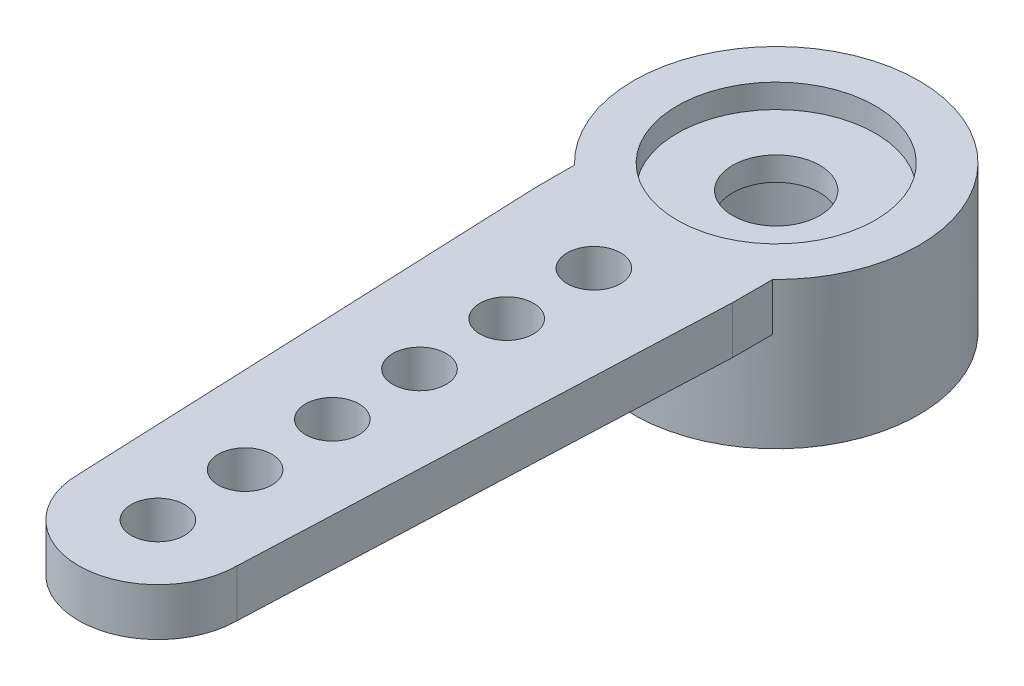
ISO-10303-21;
HEADER;
FILE_DESCRIPTION(('STEP AP214'),'2;1');
FILE_NAME('part.step','',(''),(''),'','','');
FILE_SCHEMA(('AUTOMOTIVE_DESIGN { 1 0 10303 214 1 1 1 1 }'));
ENDSEC;
DATA;
#1=APPLICATION_CONTEXT('core data for automotive mechanical design processes');
#2=APPLICATION_PROTOCOL_DEFINITION('international standard','automotive_design',2000,#1);
#3=PRODUCT_CONTEXT('',#1,'mechanical');
#4=PRODUCT('Part','Part','',(#3));
#5=PRODUCT_RELATED_PRODUCT_CATEGORY('part','',(#4));
#6=PRODUCT_DEFINITION_FORMATION('','',#4);
#7=PRODUCT_DEFINITION_CONTEXT('part definition',#1,'design');
#8=PRODUCT_DEFINITION('design','',#6,#7);
#9=PRODUCT_DEFINITION_SHAPE('','',#8);
#10=(LENGTH_UNIT() NAMED_UNIT(*) SI_UNIT(.MILLI.,.METRE.));
#11=(NAMED_UNIT(*) PLANE_ANGLE_UNIT() SI_UNIT($,.RADIAN.));
#12=(NAMED_UNIT(*) SI_UNIT($,.STERADIAN.) SOLID_ANGLE_UNIT());
#13=UNCERTAINTY_MEASURE_WITH_UNIT(LENGTH_MEASURE(1.E-05),#10,'distance_accuracy_value','');
#14=(GEOMETRIC_REPRESENTATION_CONTEXT(3) GLOBAL_UNCERTAINTY_ASSIGNED_CONTEXT((#13)) GLOBAL_UNIT_ASSIGNED_CONTEXT((#10,
#11,#12)) REPRESENTATION_CONTEXT('',''));
#15=CARTESIAN_POINT('',(0.,0.,0.));
#16=DIRECTION('',(0.,0.,1.));
#17=DIRECTION('',(1.,0.,0.));
#18=AXIS2_PLACEMENT_3D('',#15,#16,#17);
#19=CARTESIAN_POINT('',(0.,0.,7.));
#20=DIRECTION('',(0.,1.,0.));
#21=DIRECTION('',(1.,0.,0.));
#22=AXIS2_PLACEMENT_3D('',#19,#20,#21);
#23=PLANE('',#22);
#24=CARTESIAN_POINT('',(0.,0.,9.));
#25=DIRECTION('',(0.,-1.,0.));
#26=DIRECTION('',(1.,0.,0.));
#27=AXIS2_PLACEMENT_3D('',#24,#25,#26);
#28=CIRCLE('',#27,0.675);
#29=CARTESIAN_POINT('',(-0.675,0.,9.));
#30=VERTEX_POINT('',#29);
#31=EDGE_CURVE('E277',#30,#30,#28,.T.);
#32=ORIENTED_EDGE('',*,*,#31,.F.);
#33=EDGE_LOOP('',(#32));
#34=FACE_BOUND('',#33,.T.);
#35=CARTESIAN_POINT('',(0.,0.,13.4));
#36=DIRECTION('',(0.,-1.,0.));
#37=DIRECTION('',(1.,0.,0.));
#38=AXIS2_PLACEMENT_3D('',#35,#36,#37);
#39=CIRCLE('',#38,0.675);
#40=CARTESIAN_POINT('',(-0.675,0.,13.4));
#41=VERTEX_POINT('',#40);
#42=EDGE_CURVE('E225',#41,#41,#39,.T.);
#43=ORIENTED_EDGE('',*,*,#42,.F.);
#44=EDGE_LOOP('',(#43));
#45=FACE_BOUND('',#44,.T.);
#46=CARTESIAN_POINT('',(0.,0.,4.6));
#47=DIRECTION('',(0.,-1.,0.));
#48=DIRECTION('',(1.,0.,0.));
#49=AXIS2_PLACEMENT_3D('',#46,#47,#48);
#50=CIRCLE('',#49,0.675);
#51=CARTESIAN_POINT('',(-0.675,0.,4.6));
#52=VERTEX_POINT('',#51);
#53=EDGE_CURVE('E195',#52,#52,#50,.T.);
#54=ORIENTED_EDGE('',*,*,#53,.F.);
#55=EDGE_LOOP('',(#54));
#56=FACE_BOUND('',#55,.T.);
#57=CARTESIAN_POINT('',(0.,0.,11.2));
#58=DIRECTION('',(0.,-1.,0.));
#59=DIRECTION('',(1.,0.,0.));
#60=AXIS2_PLACEMENT_3D('',#57,#58,#59);
#61=CIRCLE('',#60,0.675);
#62=CARTESIAN_POINT('',(-0.675,0.,11.2));
#63=VERTEX_POINT('',#62);
#64=EDGE_CURVE('E269',#63,#63,#61,.T.);
#65=ORIENTED_EDGE('',*,*,#64,.F.);
#66=EDGE_LOOP('',(#65));
#67=FACE_BOUND('',#66,.T.);
#68=CARTESIAN_POINT('',(0.,0.,15.6));
#69=DIRECTION('',(0.,-1.,0.));
#70=DIRECTION('',(1.,0.,0.));
#71=AXIS2_PLACEMENT_3D('',#68,#69,#70);
#72=CIRCLE('',#71,0.675);
#73=CARTESIAN_POINT('',(-0.675,0.,15.6));
#74=VERTEX_POINT('',#73);
#75=EDGE_CURVE('E193',#74,#74,#72,.T.);
#76=ORIENTED_EDGE('',*,*,#75,.F.);
#77=EDGE_LOOP('',(#76));
#78=FACE_BOUND('',#77,.T.);
#79=CARTESIAN_POINT('',(0.,0.,6.8));
#80=DIRECTION('',(0.,-1.,0.));
#81=DIRECTION('',(1.,0.,0.));
#82=AXIS2_PLACEMENT_3D('',#79,#80,#81);
#83=CIRCLE('',#82,0.675);
#84=CARTESIAN_POINT('',(-0.675,0.,6.8));
#85=VERTEX_POINT('',#84);
#86=EDGE_CURVE('E20',#85,#85,#83,.T.);
#87=ORIENTED_EDGE('',*,*,#86,.F.);
#88=EDGE_LOOP('',(#87));
#89=FACE_BOUND('',#88,.T.);
#90=CARTESIAN_POINT('',(0.,0.,0.));
#91=DIRECTION('',(0.,1.,0.));
#92=DIRECTION('',(1.,0.,0.));
#93=AXIS2_PLACEMENT_3D('',#90,#91,#92);
#94=CIRCLE('',#93,3.6);
#95=CARTESIAN_POINT('',(-2.5,0.,2.59036676939772));
#96=VERTEX_POINT('',#95);
#97=CARTESIAN_POINT('',(2.5,0.,2.59036676939772));
#98=VERTEX_POINT('',#97);
#99=EDGE_CURVE('E203',#96,#98,#94,.T.);
#100=ORIENTED_EDGE('',*,*,#99,.T.);
#101=DIRECTION('',(0.,0.,-1.));
#102=VECTOR('',#101,1.);
#103=CARTESIAN_POINT('',(2.5,0.,3.6));
#104=LINE('',#103,#102);
#105=CARTESIAN_POINT('',(2.5,0.,3.6));
#106=VERTEX_POINT('',#105);
#107=EDGE_CURVE('E187',#106,#98,#104,.T.);
#108=ORIENTED_EDGE('',*,*,#107,.F.);
#109=DIRECTION('',(0.0416305447121812,0.,-0.999133073092352));
#110=VECTOR('',#109,1.);
#111=CARTESIAN_POINT('',(2.,0.,15.6));
#112=LINE('',#111,#110);
#113=CARTESIAN_POINT('',(2.,0.,15.6));
#114=VERTEX_POINT('',#113);
#115=EDGE_CURVE('E213',#114,#106,#112,.T.);
#116=ORIENTED_EDGE('',*,*,#115,.F.);
#117=CARTESIAN_POINT('',(0.,0.,15.6));
#118=DIRECTION('',(0.,1.,0.));
#119=DIRECTION('',(-1.,0.,0.));
#120=AXIS2_PLACEMENT_3D('',#117,#118,#119);
#121=CIRCLE('',#120,2.);
#122=CARTESIAN_POINT('',(-2.,0.,15.6));
#123=VERTEX_POINT('',#122);
#124=EDGE_CURVE('E301',#123,#114,#121,.T.);
#125=ORIENTED_EDGE('',*,*,#124,.F.);
#126=DIRECTION('',(-0.0416305447121814,0.,-0.999133073092352));
#127=VECTOR('',#126,1.);
#128=CARTESIAN_POINT('',(-2.,0.,15.6));
#129=LINE('',#128,#127);
#130=CARTESIAN_POINT('',(-2.5,0.,3.6));
#131=VERTEX_POINT('',#130);
#132=EDGE_CURVE('E27',#123,#131,#129,.T.);
#133=ORIENTED_EDGE('',*,*,#132,.T.);
#134=DIRECTION('',(0.,0.,-1.));
#135=VECTOR('',#134,1.);
#136=CARTESIAN_POINT('',(-2.5,0.,3.6));
#137=LINE('',#136,#135);
#138=EDGE_CURVE('E241',#131,#96,#137,.T.);
#139=ORIENTED_EDGE('',*,*,#138,.T.);
#140=EDGE_LOOP('',(#100,#108,#116,#125,#133,#139));
#141=FACE_BOUND('',#140,.T.);
#142=ADVANCED_FACE('F16',(#34,#45,#56,#67,#78,#89,#141),#23,.F.);
#143=CARTESIAN_POINT('',(0.,1.2,7.));
#144=DIRECTION('',(0.,1.,0.));
#145=DIRECTION('',(1.,0.,0.));
#146=AXIS2_PLACEMENT_3D('',#143,#144,#145);
#147=PLANE('',#146);
#148=CARTESIAN_POINT('',(0.,1.2,9.));
#149=DIRECTION('',(0.,-1.,0.));
#150=DIRECTION('',(1.,0.,0.));
#151=AXIS2_PLACEMENT_3D('',#148,#149,#150);
#152=CIRCLE('',#151,0.675);
#153=CARTESIAN_POINT('',(-0.675,1.2,9.));
#154=VERTEX_POINT('',#153);
#155=EDGE_CURVE('E286',#154,#154,#152,.T.);
#156=ORIENTED_EDGE('',*,*,#155,.T.);
#157=EDGE_LOOP('',(#156));
#158=FACE_BOUND('',#157,.T.);
#159=CARTESIAN_POINT('',(0.,1.2,13.4));
#160=DIRECTION('',(0.,-1.,0.));
#161=DIRECTION('',(1.,0.,0.));
#162=AXIS2_PLACEMENT_3D('',#159,#160,#161);
#163=CIRCLE('',#162,0.675);
#164=CARTESIAN_POINT('',(-0.675,1.2,13.4));
#165=VERTEX_POINT('',#164);
#166=EDGE_CURVE('E255',#165,#165,#163,.T.);
#167=ORIENTED_EDGE('',*,*,#166,.T.);
#168=EDGE_LOOP('',(#167));
#169=FACE_BOUND('',#168,.T.);
#170=CARTESIAN_POINT('',(0.,1.2,4.6));
#171=DIRECTION('',(0.,-1.,0.));
#172=DIRECTION('',(1.,0.,0.));
#173=AXIS2_PLACEMENT_3D('',#170,#171,#172);
#174=CIRCLE('',#173,0.675);
#175=CARTESIAN_POINT('',(-0.675,1.2,4.6));
#176=VERTEX_POINT('',#175);
#177=EDGE_CURVE('E221',#176,#176,#174,.T.);
#178=ORIENTED_EDGE('',*,*,#177,.T.);
#179=EDGE_LOOP('',(#178));
#180=FACE_BOUND('',#179,.T.);
#181=CARTESIAN_POINT('',(0.,1.2,11.2));
#182=DIRECTION('',(0.,-1.,0.));
#183=DIRECTION('',(1.,0.,0.));
#184=AXIS2_PLACEMENT_3D('',#181,#182,#183);
#185=CIRCLE('',#184,0.675);
#186=CARTESIAN_POINT('',(-0.675,1.2,11.2));
#187=VERTEX_POINT('',#186);
#188=EDGE_CURVE('E198',#187,#187,#185,.T.);
#189=ORIENTED_EDGE('',*,*,#188,.T.);
#190=EDGE_LOOP('',(#189));
#191=FACE_BOUND('',#190,.T.);
#192=CARTESIAN_POINT('',(0.,1.2,15.6));
#193=DIRECTION('',(0.,-1.,0.));
#194=DIRECTION('',(1.,0.,0.));
#195=AXIS2_PLACEMENT_3D('',#192,#193,#194);
#196=CIRCLE('',#195,0.675);
#197=CARTESIAN_POINT('',(-0.675,1.2,15.6));
#198=VERTEX_POINT('',#197);
#199=EDGE_CURVE('E194',#198,#198,#196,.T.);
#200=ORIENTED_EDGE('',*,*,#199,.T.);
#201=EDGE_LOOP('',(#200));
#202=FACE_BOUND('',#201,.T.);
#203=CARTESIAN_POINT('',(0.,1.2,6.8));
#204=DIRECTION('',(0.,-1.,0.));
#205=DIRECTION('',(1.,0.,0.));
#206=AXIS2_PLACEMENT_3D('',#203,#204,#205);
#207=CIRCLE('',#206,0.675);
#208=CARTESIAN_POINT('',(-0.675,1.2,6.8));
#209=VERTEX_POINT('',#208);
#210=EDGE_CURVE('E229',#209,#209,#207,.T.);
#211=ORIENTED_EDGE('',*,*,#210,.T.);
#212=EDGE_LOOP('',(#211));
#213=FACE_BOUND('',#212,.T.);
#214=CARTESIAN_POINT('',(0.,1.2,0.));
#215=DIRECTION('',(0.,-1.,0.));
#216=DIRECTION('',(-1.,0.,0.));
#217=AXIS2_PLACEMENT_3D('',#214,#215,#216);
#218=CIRCLE('',#217,2.5);
#219=CARTESIAN_POINT('',(2.5,1.2,0.));
#220=VERTEX_POINT('',#219);
#221=EDGE_CURVE('E237',#220,#220,#218,.T.);
#222=ORIENTED_EDGE('',*,*,#221,.T.);
#223=EDGE_LOOP('',(#222));
#224=FACE_BOUND('',#223,.T.);
#225=DIRECTION('',(0.0416305447121814,0.,0.999133073092352));
#226=VECTOR('',#225,1.);
#227=CARTESIAN_POINT('',(-2.,1.2,15.6));
#228=LINE('',#227,#226);
#229=CARTESIAN_POINT('',(-2.5,1.2,3.6));
#230=VERTEX_POINT('',#229);
#231=CARTESIAN_POINT('',(-2.,1.2,15.6));
#232=VERTEX_POINT('',#231);
#233=EDGE_CURVE('E11',#230,#232,#228,.T.);
#234=ORIENTED_EDGE('',*,*,#233,.T.);
#235=CARTESIAN_POINT('',(0.,1.2,15.6));
#236=DIRECTION('',(0.,1.,0.));
#237=DIRECTION('',(-1.,0.,0.));
#238=AXIS2_PLACEMENT_3D('',#235,#236,#237);
#239=CIRCLE('',#238,2.);
#240=CARTESIAN_POINT('',(2.,1.2,15.6));
#241=VERTEX_POINT('',#240);
#242=EDGE_CURVE('E264',#232,#241,#239,.T.);
#243=ORIENTED_EDGE('',*,*,#242,.T.);
#244=DIRECTION('',(0.0416305447121812,0.,-0.999133073092352));
#245=VECTOR('',#244,1.);
#246=CARTESIAN_POINT('',(2.,1.2,15.6));
#247=LINE('',#246,#245);
#248=CARTESIAN_POINT('',(2.5,1.2,3.6));
#249=VERTEX_POINT('',#248);
#250=EDGE_CURVE('E209',#241,#249,#247,.T.);
#251=ORIENTED_EDGE('',*,*,#250,.T.);
#252=DIRECTION('',(0.,0.,-1.));
#253=VECTOR('',#252,1.);
#254=CARTESIAN_POINT('',(2.5,1.2,3.6));
#255=LINE('',#254,#253);
#256=CARTESIAN_POINT('',(2.5,1.2,2.59036676939772));
#257=VERTEX_POINT('',#256);
#258=EDGE_CURVE('E311',#249,#257,#255,.T.);
#259=ORIENTED_EDGE('',*,*,#258,.T.);
#260=CARTESIAN_POINT('',(0.,1.2,0.));
#261=DIRECTION('',(0.,1.,0.));
#262=DIRECTION('',(1.,0.,0.));
#263=AXIS2_PLACEMENT_3D('',#260,#261,#262);
#264=CIRCLE('',#263,3.6);
#265=CARTESIAN_POINT('',(-3.6,1.2,0.));
#266=VERTEX_POINT('',#265);
#267=EDGE_CURVE('E188',#257,#266,#264,.T.);
#268=ORIENTED_EDGE('',*,*,#267,.T.);
#269=CARTESIAN_POINT('',(0.,1.2,0.));
#270=DIRECTION('',(0.,1.,0.));
#271=DIRECTION('',(1.,0.,0.));
#272=AXIS2_PLACEMENT_3D('',#269,#270,#271);
#273=CIRCLE('',#272,3.6);
#274=CARTESIAN_POINT('',(-2.5,1.2,2.59036676939772));
#275=VERTEX_POINT('',#274);
#276=EDGE_CURVE('E207',#266,#275,#273,.T.);
#277=ORIENTED_EDGE('',*,*,#276,.T.);
#278=DIRECTION('',(0.,0.,1.));
#279=VECTOR('',#278,1.);
#280=CARTESIAN_POINT('',(-2.5,1.2,3.6));
#281=LINE('',#280,#279);
#282=EDGE_CURVE('E217',#275,#230,#281,.T.);
#283=ORIENTED_EDGE('',*,*,#282,.T.);
#284=EDGE_LOOP('',(#234,#243,#251,#259,#268,#277,#283));
#285=FACE_BOUND('',#284,.T.);
#286=ADVANCED_FACE('F357',(#158,#169,#180,#191,#202,#213,#224,#285),#147,.T.);
#287=CARTESIAN_POINT('',(-2.5,0.,3.6));
#288=DIRECTION('',(-0.999133073092352,0.,0.0416305447121814));
#289=DIRECTION('',(0.,1.,0.));
#290=AXIS2_PLACEMENT_3D('',#287,#288,#289);
#291=PLANE('',#290);
#292=ORIENTED_EDGE('',*,*,#132,.F.);
#293=DIRECTION('',(0.,1.,0.));
#294=VECTOR('',#293,1.);
#295=CARTESIAN_POINT('',(-2.,0.,15.6));
#296=LINE('',#295,#294);
#297=EDGE_CURVE('E261',#123,#232,#296,.T.);
#298=ORIENTED_EDGE('',*,*,#297,.T.);
#299=ORIENTED_EDGE('',*,*,#233,.F.);
#300=DIRECTION('',(0.,1.,0.));
#301=VECTOR('',#300,1.);
#302=CARTESIAN_POINT('',(-2.5,0.,3.6));
#303=LINE('',#302,#301);
#304=EDGE_CURVE('E220',#131,#230,#303,.T.);
#305=ORIENTED_EDGE('',*,*,#304,.F.);
#306=EDGE_LOOP('',(#292,#298,#299,#305));
#307=FACE_BOUND('',#306,.T.);
#308=ADVANCED_FACE('F382',(#307),#291,.T.);
#309=CARTESIAN_POINT('',(0.,0.,15.6));
#310=DIRECTION('',(0.,1.,0.));
#311=DIRECTION('',(-1.,0.,0.));
#312=AXIS2_PLACEMENT_3D('',#309,#310,#311);
#313=CYLINDRICAL_SURFACE('',#312,2.);
#314=ORIENTED_EDGE('',*,*,#124,.T.);
#315=DIRECTION('',(0.,1.,0.));
#316=VECTOR('',#315,1.);
#317=CARTESIAN_POINT('',(2.,0.,15.6));
#318=LINE('',#317,#316);
#319=EDGE_CURVE('E212',#114,#241,#318,.T.);
#320=ORIENTED_EDGE('',*,*,#319,.T.);
#321=ORIENTED_EDGE('',*,*,#242,.F.);
#322=ORIENTED_EDGE('',*,*,#297,.F.);
#323=EDGE_LOOP('',(#314,#320,#321,#322));
#324=FACE_BOUND('',#323,.T.);
#325=ADVANCED_FACE('F396',(#324),#313,.T.);
#326=CARTESIAN_POINT('',(2.,0.,15.6));
#327=DIRECTION('',(0.999133073092352,0.,0.0416305447121812));
#328=DIRECTION('',(0.,-1.,0.));
#329=AXIS2_PLACEMENT_3D('',#326,#327,#328);
#330=PLANE('',#329);
#331=ORIENTED_EDGE('',*,*,#115,.T.);
#332=DIRECTION('',(0.,1.,0.));
#333=VECTOR('',#332,1.);
#334=CARTESIAN_POINT('',(2.5,0.,3.6));
#335=LINE('',#334,#333);
#336=EDGE_CURVE('E307',#106,#249,#335,.T.);
#337=ORIENTED_EDGE('',*,*,#336,.T.);
#338=ORIENTED_EDGE('',*,*,#250,.F.);
#339=ORIENTED_EDGE('',*,*,#319,.F.);
#340=EDGE_LOOP('',(#331,#337,#338,#339));
#341=FACE_BOUND('',#340,.T.);
#342=ADVANCED_FACE('F401',(#341),#330,.T.);
#343=CARTESIAN_POINT('',(2.5,0.,3.6));
#344=DIRECTION('',(1.,0.,0.));
#345=DIRECTION('',(0.,0.,-1.));
#346=AXIS2_PLACEMENT_3D('',#343,#344,#345);
#347=PLANE('',#346);
#348=ORIENTED_EDGE('',*,*,#107,.T.);
#349=DIRECTION('',(0.,1.,0.));
#350=VECTOR('',#349,1.);
#351=CARTESIAN_POINT('',(2.5,0.,2.59036676939772));
#352=LINE('',#351,#350);
#353=EDGE_CURVE('E184',#98,#257,#352,.T.);
#354=ORIENTED_EDGE('',*,*,#353,.T.);
#355=ORIENTED_EDGE('',*,*,#258,.F.);
#356=ORIENTED_EDGE('',*,*,#336,.F.);
#357=EDGE_LOOP('',(#348,#354,#355,#356));
#358=FACE_BOUND('',#357,.T.);
#359=ADVANCED_FACE('F340',(#358),#347,.T.);
#360=CARTESIAN_POINT('',(0.,0.,0.));
#361=DIRECTION('',(0.,1.,0.));
#362=DIRECTION('',(1.,0.,0.));
#363=AXIS2_PLACEMENT_3D('',#360,#361,#362);
#364=CYLINDRICAL_SURFACE('',#363,3.6);
#365=ORIENTED_EDGE('',*,*,#99,.F.);
#366=DIRECTION('',(0.,1.,0.));
#367=VECTOR('',#366,1.);
#368=CARTESIAN_POINT('',(-2.5,0.,2.59036676939772));
#369=LINE('',#368,#367);
#370=EDGE_CURVE('E208',#96,#275,#369,.T.);
#371=ORIENTED_EDGE('',*,*,#370,.T.);
#372=ORIENTED_EDGE('',*,*,#276,.F.);
#373=DIRECTION('',(0.,-1.,0.));
#374=VECTOR('',#373,1.);
#375=CARTESIAN_POINT('',(-3.6,0.,0.));
#376=LINE('',#375,#374);
#377=CARTESIAN_POINT('',(-3.6,-2.5,0.));
#378=VERTEX_POINT('',#377);
#379=EDGE_CURVE('E228',#266,#378,#376,.T.);
#380=ORIENTED_EDGE('',*,*,#379,.T.);
#381=CARTESIAN_POINT('',(0.,-2.5,0.));
#382=DIRECTION('',(0.,-1.,0.));
#383=DIRECTION('',(1.,0.,0.));
#384=AXIS2_PLACEMENT_3D('',#381,#382,#383);
#385=CIRCLE('',#384,3.6);
#386=EDGE_CURVE('E249',#378,#378,#385,.T.);
#387=ORIENTED_EDGE('',*,*,#386,.F.);
#388=ORIENTED_EDGE('',*,*,#379,.F.);
#389=ORIENTED_EDGE('',*,*,#267,.F.);
#390=ORIENTED_EDGE('',*,*,#353,.F.);
#391=EDGE_LOOP('',(#365,#371,#372,#380,#387,#388,#389,#390));
#392=FACE_BOUND('',#391,.T.);
#393=ADVANCED_FACE('F346',(#392),#364,.T.);
#394=CARTESIAN_POINT('',(-2.5,0.,2.59036676939772));
#395=DIRECTION('',(-1.,0.,0.));
#396=DIRECTION('',(0.,0.,1.));
#397=AXIS2_PLACEMENT_3D('',#394,#395,#396);
#398=PLANE('',#397);
#399=ORIENTED_EDGE('',*,*,#138,.F.);
#400=ORIENTED_EDGE('',*,*,#304,.T.);
#401=ORIENTED_EDGE('',*,*,#282,.F.);
#402=ORIENTED_EDGE('',*,*,#370,.F.);
#403=EDGE_LOOP('',(#399,#400,#401,#402));
#404=FACE_BOUND('',#403,.T.);
#405=ADVANCED_FACE('F353',(#404),#398,.T.);
#406=CARTESIAN_POINT('',(0.,0.,6.8));
#407=DIRECTION('',(0.,1.,0.));
#408=DIRECTION('',(1.,0.,0.));
#409=AXIS2_PLACEMENT_3D('',#406,#407,#408);
#410=CYLINDRICAL_SURFACE('',#409,0.675);
#411=ORIENTED_EDGE('',*,*,#210,.F.);
#412=DIRECTION('',(0.,-1.,0.));
#413=VECTOR('',#412,1.);
#414=CARTESIAN_POINT('',(-0.675,0.,6.8));
#415=LINE('',#414,#413);
#416=EDGE_CURVE('E233',#209,#85,#415,.T.);
#417=ORIENTED_EDGE('',*,*,#416,.T.);
#418=ORIENTED_EDGE('',*,*,#86,.T.);
#419=ORIENTED_EDGE('',*,*,#416,.F.);
#420=EDGE_LOOP('',(#411,#417,#418,#419));
#421=FACE_BOUND('',#420,.T.);
#422=ADVANCED_FACE('F418',(#421),#410,.F.);
#423=CARTESIAN_POINT('',(0.,0.,15.6));
#424=DIRECTION('',(0.,1.,0.));
#425=DIRECTION('',(1.,0.,0.));
#426=AXIS2_PLACEMENT_3D('',#423,#424,#425);
#427=CYLINDRICAL_SURFACE('',#426,0.675);
#428=ORIENTED_EDGE('',*,*,#199,.F.);
#429=DIRECTION('',(0.,-1.,0.));
#430=VECTOR('',#429,1.);
#431=CARTESIAN_POINT('',(-0.675,0.,15.6));
#432=LINE('',#431,#430);
#433=EDGE_CURVE('E189',#198,#74,#432,.T.);
#434=ORIENTED_EDGE('',*,*,#433,.T.);
#435=ORIENTED_EDGE('',*,*,#75,.T.);
#436=ORIENTED_EDGE('',*,*,#433,.F.);
#437=EDGE_LOOP('',(#428,#434,#435,#436));
#438=FACE_BOUND('',#437,.T.);
#439=ADVANCED_FACE('F420',(#438),#427,.F.);
#440=CARTESIAN_POINT('',(0.,0.,11.2));
#441=DIRECTION('',(0.,1.,0.));
#442=DIRECTION('',(1.,0.,0.));
#443=AXIS2_PLACEMENT_3D('',#440,#441,#442);
#444=CYLINDRICAL_SURFACE('',#443,0.675);
#445=ORIENTED_EDGE('',*,*,#188,.F.);
#446=DIRECTION('',(0.,-1.,0.));
#447=VECTOR('',#446,1.);
#448=CARTESIAN_POINT('',(-0.675,0.,11.2));
#449=LINE('',#448,#447);
#450=EDGE_CURVE('E265',#187,#63,#449,.T.);
#451=ORIENTED_EDGE('',*,*,#450,.T.);
#452=ORIENTED_EDGE('',*,*,#64,.T.);
#453=ORIENTED_EDGE('',*,*,#450,.F.);
#454=EDGE_LOOP('',(#445,#451,#452,#453));
#455=FACE_BOUND('',#454,.T.);
#456=ADVANCED_FACE('F391',(#455),#444,.F.);
#457=CARTESIAN_POINT('',(0.,0.,4.6));
#458=DIRECTION('',(0.,1.,0.));
#459=DIRECTION('',(1.,0.,0.));
#460=AXIS2_PLACEMENT_3D('',#457,#458,#459);
#461=CYLINDRICAL_SURFACE('',#460,0.675);
#462=ORIENTED_EDGE('',*,*,#177,.F.);
#463=DIRECTION('',(0.,-1.,0.));
#464=VECTOR('',#463,1.);
#465=CARTESIAN_POINT('',(-0.675,0.,4.6));
#466=LINE('',#465,#464);
#467=EDGE_CURVE('E199',#176,#52,#466,.T.);
#468=ORIENTED_EDGE('',*,*,#467,.T.);
#469=ORIENTED_EDGE('',*,*,#53,.T.);
#470=ORIENTED_EDGE('',*,*,#467,.F.);
#471=EDGE_LOOP('',(#462,#468,#469,#470));
#472=FACE_BOUND('',#471,.T.);
#473=ADVANCED_FACE('F387',(#472),#461,.F.);
#474=CARTESIAN_POINT('',(0.,0.,13.4));
#475=DIRECTION('',(0.,1.,0.));
#476=DIRECTION('',(1.,0.,0.));
#477=AXIS2_PLACEMENT_3D('',#474,#475,#476);
#478=CYLINDRICAL_SURFACE('',#477,0.675);
#479=ORIENTED_EDGE('',*,*,#166,.F.);
#480=DIRECTION('',(0.,-1.,0.));
#481=VECTOR('',#480,1.);
#482=CARTESIAN_POINT('',(-0.675,0.,13.4));
#483=LINE('',#482,#481);
#484=EDGE_CURVE('E258',#165,#41,#483,.T.);
#485=ORIENTED_EDGE('',*,*,#484,.T.);
#486=ORIENTED_EDGE('',*,*,#42,.T.);
#487=ORIENTED_EDGE('',*,*,#484,.F.);
#488=EDGE_LOOP('',(#479,#485,#486,#487));
#489=FACE_BOUND('',#488,.T.);
#490=ADVANCED_FACE('F390',(#489),#478,.F.);
#491=CARTESIAN_POINT('',(0.,0.,0.));
#492=DIRECTION('',(0.,1.,0.));
#493=DIRECTION('',(1.,0.,0.));
#494=AXIS2_PLACEMENT_3D('',#491,#492,#493);
#495=CYLINDRICAL_SURFACE('',#494,2.5);
#496=CARTESIAN_POINT('',(0.,0.,0.));
#497=DIRECTION('',(0.,1.,0.));
#498=DIRECTION('',(1.,0.,0.));
#499=AXIS2_PLACEMENT_3D('',#496,#497,#498);
#500=CIRCLE('',#499,2.5);
#501=CARTESIAN_POINT('',(-2.5,0.,0.));
#502=VERTEX_POINT('',#501);
#503=EDGE_CURVE('E245',#502,#502,#500,.T.);
#504=ORIENTED_EDGE('',*,*,#503,.T.);
#505=DIRECTION('',(0.,-1.,0.));
#506=VECTOR('',#505,1.);
#507=CARTESIAN_POINT('',(-2.5,0.,0.));
#508=LINE('',#507,#506);
#509=CARTESIAN_POINT('',(-2.5,-2.5,0.));
#510=VERTEX_POINT('',#509);
#511=EDGE_CURVE('E259',#502,#510,#508,.T.);
#512=ORIENTED_EDGE('',*,*,#511,.T.);
#513=CARTESIAN_POINT('',(0.,-2.5,0.));
#514=DIRECTION('',(0.,1.,0.));
#515=DIRECTION('',(1.,0.,0.));
#516=AXIS2_PLACEMENT_3D('',#513,#514,#515);
#517=CIRCLE('',#516,2.5);
#518=EDGE_CURVE('E273',#510,#510,#517,.T.);
#519=ORIENTED_EDGE('',*,*,#518,.F.);
#520=ORIENTED_EDGE('',*,*,#511,.F.);
#521=EDGE_LOOP('',(#504,#512,#519,#520));
#522=FACE_BOUND('',#521,.T.);
#523=ADVANCED_FACE('F372',(#522),#495,.F.);
#524=CARTESIAN_POINT('',(0.,0.,9.));
#525=DIRECTION('',(0.,1.,0.));
#526=DIRECTION('',(1.,0.,0.));
#527=AXIS2_PLACEMENT_3D('',#524,#525,#526);
#528=CYLINDRICAL_SURFACE('',#527,0.675);
#529=ORIENTED_EDGE('',*,*,#155,.F.);
#530=DIRECTION('',(0.,-1.,0.));
#531=VECTOR('',#530,1.);
#532=CARTESIAN_POINT('',(-0.675,0.,9.));
#533=LINE('',#532,#531);
#534=EDGE_CURVE('E280',#154,#30,#533,.T.);
#535=ORIENTED_EDGE('',*,*,#534,.T.);
#536=ORIENTED_EDGE('',*,*,#31,.T.);
#537=ORIENTED_EDGE('',*,*,#534,.F.);
#538=EDGE_LOOP('',(#529,#535,#536,#537));
#539=FACE_BOUND('',#538,.T.);
#540=ADVANCED_FACE('F362',(#539),#528,.F.);
#541=CARTESIAN_POINT('',(0.,-2.5,0.));
#542=DIRECTION('',(0.,1.,0.));
#543=DIRECTION('',(1.,0.,0.));
#544=AXIS2_PLACEMENT_3D('',#541,#542,#543);
#545=PLANE('',#544);
#546=ORIENTED_EDGE('',*,*,#518,.T.);
#547=EDGE_LOOP('',(#546));
#548=FACE_BOUND('',#547,.T.);
#549=ORIENTED_EDGE('',*,*,#386,.T.);
#550=EDGE_LOOP('',(#549));
#551=FACE_BOUND('',#550,.T.);
#552=ADVANCED_FACE('F359',(#548,#551),#545,.F.);
#553=CARTESIAN_POINT('',(0.,0.,0.));
#554=DIRECTION('',(0.,1.,0.));
#555=DIRECTION('',(1.,0.,0.));
#556=AXIS2_PLACEMENT_3D('',#553,#554,#555);
#557=PLANE('',#556);
#558=CARTESIAN_POINT('',(0.,0.,0.));
#559=DIRECTION('',(0.,-1.,0.));
#560=DIRECTION('',(1.,0.,0.));
#561=AXIS2_PLACEMENT_3D('',#558,#559,#560);
#562=CIRCLE('',#561,1.1);
#563=CARTESIAN_POINT('',(-1.1,0.,0.));
#564=VERTEX_POINT('',#563);
#565=EDGE_CURVE('E202',#564,#564,#562,.T.);
#566=ORIENTED_EDGE('',*,*,#565,.F.);
#567=EDGE_LOOP('',(#566));
#568=FACE_BOUND('',#567,.T.);
#569=ORIENTED_EDGE('',*,*,#503,.F.);
#570=EDGE_LOOP('',(#569));
#571=FACE_BOUND('',#570,.T.);
#572=ADVANCED_FACE('F361',(#568,#571),#557,.F.);
#573=CARTESIAN_POINT('',(0.,0.,0.));
#574=DIRECTION('',(0.,1.,0.));
#575=DIRECTION('',(1.,0.,0.));
#576=AXIS2_PLACEMENT_3D('',#573,#574,#575);
#577=CYLINDRICAL_SURFACE('',#576,1.1);
#578=CARTESIAN_POINT('',(0.,0.6,0.));
#579=DIRECTION('',(0.,1.,0.));
#580=DIRECTION('',(1.,0.,0.));
#581=AXIS2_PLACEMENT_3D('',#578,#579,#580);
#582=CIRCLE('',#581,1.1);
#583=CARTESIAN_POINT('',(1.1,0.6,0.));
#584=VERTEX_POINT('',#583);
#585=CARTESIAN_POINT('',(-1.1,0.6,0.));
#586=VERTEX_POINT('',#585);
#587=EDGE_CURVE('E168',#584,#586,#582,.T.);
#588=ORIENTED_EDGE('',*,*,#587,.T.);
#589=DIRECTION('',(0.,-1.,0.));
#590=VECTOR('',#589,1.);
#591=CARTESIAN_POINT('',(-1.1,0.,0.));
#592=LINE('',#591,#590);
#593=EDGE_CURVE('E169',#586,#564,#592,.T.);
#594=ORIENTED_EDGE('',*,*,#593,.T.);
#595=ORIENTED_EDGE('',*,*,#565,.T.);
#596=ORIENTED_EDGE('',*,*,#593,.F.);
#597=CARTESIAN_POINT('',(0.,0.6,0.));
#598=DIRECTION('',(0.,1.,0.));
#599=DIRECTION('',(1.,0.,0.));
#600=AXIS2_PLACEMENT_3D('',#597,#598,#599);
#601=CIRCLE('',#600,1.1);
#602=EDGE_CURVE('E165',#586,#584,#601,.T.);
#603=ORIENTED_EDGE('',*,*,#602,.T.);
#604=EDGE_LOOP('',(#588,#594,#595,#596,#603));
#605=FACE_BOUND('',#604,.T.);
#606=ADVANCED_FACE('F18',(#605),#577,.F.);
#607=CARTESIAN_POINT('',(0.,0.6,0.));
#608=DIRECTION('',(0.,1.,0.));
#609=DIRECTION('',(1.,0.,0.));
#610=AXIS2_PLACEMENT_3D('',#607,#608,#609);
#611=PLANE('',#610);
#612=ORIENTED_EDGE('',*,*,#587,.F.);
#613=ORIENTED_EDGE('',*,*,#602,.F.);
#614=EDGE_LOOP('',(#612,#613));
#615=FACE_BOUND('',#614,.T.);
#616=CARTESIAN_POINT('',(0.,0.6,0.));
#617=DIRECTION('',(0.,-1.,0.));
#618=DIRECTION('',(-1.,0.,0.));
#619=AXIS2_PLACEMENT_3D('',#616,#617,#618);
#620=CIRCLE('',#619,2.5);
#621=CARTESIAN_POINT('',(2.5,0.6,0.));
#622=VERTEX_POINT('',#621);
#623=EDGE_CURVE('E176',#622,#622,#620,.T.);
#624=ORIENTED_EDGE('',*,*,#623,.F.);
#625=EDGE_LOOP('',(#624));
#626=FACE_BOUND('',#625,.T.);
#627=ADVANCED_FACE('F173',(#615,#626),#611,.T.);
#628=CARTESIAN_POINT('',(0.,1.2,0.));
#629=DIRECTION('',(0.,-1.,0.));
#630=DIRECTION('',(-1.,0.,0.));
#631=AXIS2_PLACEMENT_3D('',#628,#629,#630);
#632=CYLINDRICAL_SURFACE('',#631,2.5);
#633=ORIENTED_EDGE('',*,*,#221,.F.);
#634=DIRECTION('',(0.,-1.,0.));
#635=VECTOR('',#634,1.);
#636=CARTESIAN_POINT('',(2.5,1.2,0.));
#637=LINE('',#636,#635);
#638=EDGE_CURVE('E181',#220,#622,#637,.T.);
#639=ORIENTED_EDGE('',*,*,#638,.T.);
#640=ORIENTED_EDGE('',*,*,#623,.T.);
#641=ORIENTED_EDGE('',*,*,#638,.F.);
#642=EDGE_LOOP('',(#633,#639,#640,#641));
#643=FACE_BOUND('',#642,.T.);
#644=ADVANCED_FACE('F433',(#643),#632,.F.);
#645=CLOSED_SHELL('',(#142,#286,#308,#325,#342,#359,#393,#405,#422,#439,#456,#473,#490,#523,
#540,#552,#572,#606,#627,#644));
#646=MANIFOLD_SOLID_BREP('B1',#645);
#647=ADVANCED_BREP_SHAPE_REPRESENTATION('',(#18,#646),#14);
#648=SHAPE_DEFINITION_REPRESENTATION(#9,#647);
ENDSEC;
END-ISO-10303-21;
